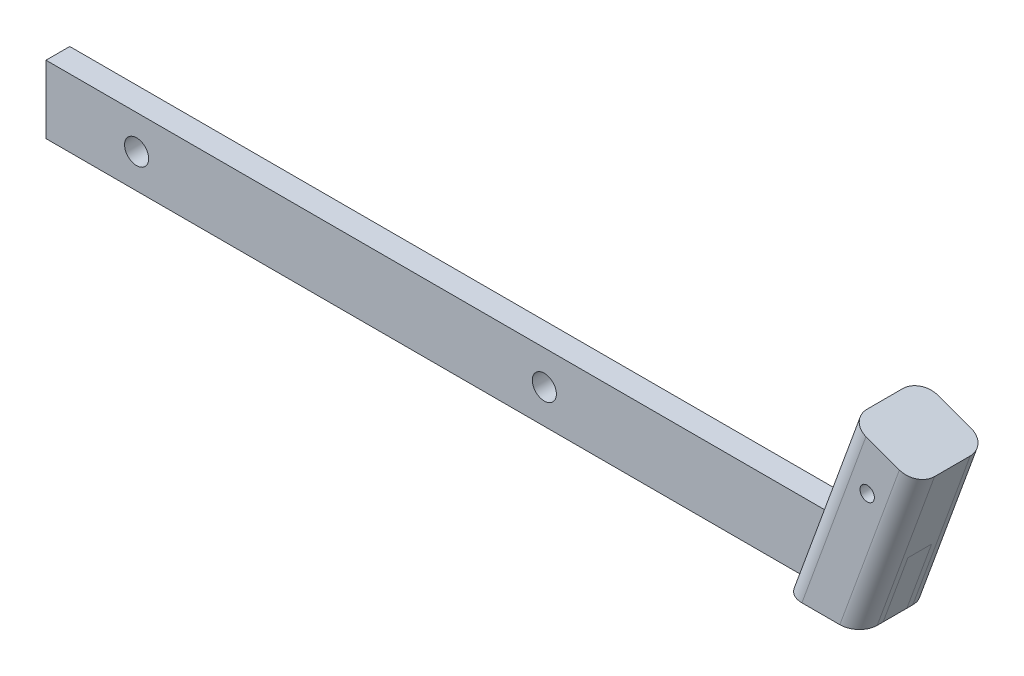
ISO-10303-21;
HEADER;
FILE_DESCRIPTION(('STEP AP214'),'2;1');
FILE_NAME('part.step','',(''),(''),'','','');
FILE_SCHEMA(('AUTOMOTIVE_DESIGN { 1 0 10303 214 1 1 1 1 }'));
ENDSEC;
DATA;
#1=APPLICATION_CONTEXT('core data for automotive mechanical design processes');
#2=APPLICATION_PROTOCOL_DEFINITION('international standard','automotive_design',2000,#1);
#3=PRODUCT_CONTEXT('',#1,'mechanical');
#4=PRODUCT('Part','Part','',(#3));
#5=PRODUCT_RELATED_PRODUCT_CATEGORY('part','',(#4));
#6=PRODUCT_DEFINITION_FORMATION('','',#4);
#7=PRODUCT_DEFINITION_CONTEXT('part definition',#1,'design');
#8=PRODUCT_DEFINITION('design','',#6,#7);
#9=PRODUCT_DEFINITION_SHAPE('','',#8);
#10=(LENGTH_UNIT() NAMED_UNIT(*) SI_UNIT(.MILLI.,.METRE.));
#11=(NAMED_UNIT(*) PLANE_ANGLE_UNIT() SI_UNIT($,.RADIAN.));
#12=(NAMED_UNIT(*) SI_UNIT($,.STERADIAN.) SOLID_ANGLE_UNIT());
#13=UNCERTAINTY_MEASURE_WITH_UNIT(LENGTH_MEASURE(1.E-05),#10,'distance_accuracy_value','');
#14=(GEOMETRIC_REPRESENTATION_CONTEXT(3) GLOBAL_UNCERTAINTY_ASSIGNED_CONTEXT((#13)) GLOBAL_UNIT_ASSIGNED_CONTEXT((#10,
#11,#12)) REPRESENTATION_CONTEXT('',''));
#15=CARTESIAN_POINT('',(0.,0.,0.));
#16=DIRECTION('',(0.,0.,1.));
#17=DIRECTION('',(1.,0.,0.));
#18=AXIS2_PLACEMENT_3D('',#15,#16,#17);
#19=CARTESIAN_POINT('',(-0.591461060722706,-31.0709524033044,-10.0711));
#20=DIRECTION('',(0.939692620785907,-0.342020143325673,0.));
#21=DIRECTION('',(0.342020143325673,0.939692620785907,0.));
#22=AXIS2_PLACEMENT_3D('',#19,#20,#21);
#23=PLANE('',#22);
#24=DIRECTION('',(-0.342020143325673,-0.939692620785907,0.));
#25=VECTOR('',#24,1.);
#26=CARTESIAN_POINT('',(13.5592119812616,7.80770224963224,-3.32740000000001));
#27=LINE('',#26,#25);
#28=CARTESIAN_POINT('',(17.6510737271534,19.05,-3.32740000000001));
#29=VERTEX_POINT('',#28);
#30=CARTESIAN_POINT('',(10.7174407643822,0.,-3.32740000000001));
#31=VERTEX_POINT('',#30);
#32=EDGE_CURVE('E57',#29,#31,#27,.T.);
#33=ORIENTED_EDGE('',*,*,#32,.F.);
#34=DIRECTION('',(0.,0.,-1.));
#35=VECTOR('',#34,1.);
#36=CARTESIAN_POINT('',(17.6510737271534,19.05,-3.3274));
#37=LINE('',#36,#35);
#38=CARTESIAN_POINT('',(17.6510737271534,19.05,3.32739999999999));
#39=VERTEX_POINT('',#38);
#40=EDGE_CURVE('E80',#39,#29,#37,.T.);
#41=ORIENTED_EDGE('',*,*,#40,.F.);
#42=DIRECTION('',(0.342020143325673,0.939692620785907,0.));
#43=VECTOR('',#42,1.);
#44=CARTESIAN_POINT('',(13.5592119812616,7.80770224963224,3.3274));
#45=LINE('',#44,#43);
#46=CARTESIAN_POINT('',(10.7174407643822,0.,3.32740000000001));
#47=VERTEX_POINT('',#46);
#48=EDGE_CURVE('E85',#47,#39,#45,.T.);
#49=ORIENTED_EDGE('',*,*,#48,.F.);
#50=DIRECTION('',(0.,0.,1.));
#51=VECTOR('',#50,1.);
#52=CARTESIAN_POINT('',(10.7174407643822,0.,-3.3274));
#53=LINE('',#52,#51);
#54=EDGE_CURVE('E100',#31,#47,#53,.T.);
#55=ORIENTED_EDGE('',*,*,#54,.F.);
#56=EDGE_LOOP('',(#33,#41,#49,#55));
#57=FACE_BOUND('',#56,.T.);
#58=ADVANCED_FACE('F49',(#57),#23,.T.);
#59=CARTESIAN_POINT('',(-223.965917593072,0.,0.));
#60=DIRECTION('',(1.,0.,0.));
#61=DIRECTION('',(0.,0.,-1.));
#62=AXIS2_PLACEMENT_3D('',#59,#60,#61);
#63=PLANE('',#62);
#64=DIRECTION('',(0.,-1.,0.));
#65=VECTOR('',#64,1.);
#66=CARTESIAN_POINT('',(-223.965917593072,0.,-3.32740000000001));
#67=LINE('',#66,#65);
#68=CARTESIAN_POINT('',(-223.965917593072,19.05,-3.32740000000001));
#69=VERTEX_POINT('',#68);
#70=CARTESIAN_POINT('',(-223.965917593072,0.,-3.32740000000001));
#71=VERTEX_POINT('',#70);
#72=EDGE_CURVE('E109',#69,#71,#67,.T.);
#73=ORIENTED_EDGE('',*,*,#72,.T.);
#74=DIRECTION('',(0.,0.,1.));
#75=VECTOR('',#74,1.);
#76=CARTESIAN_POINT('',(-223.965917593072,0.,-3.32740000000001));
#77=LINE('',#76,#75);
#78=CARTESIAN_POINT('',(-223.965917593072,0.,3.32740000000001));
#79=VERTEX_POINT('',#78);
#80=EDGE_CURVE('E98',#71,#79,#77,.T.);
#81=ORIENTED_EDGE('',*,*,#80,.T.);
#82=DIRECTION('',(0.,1.,0.));
#83=VECTOR('',#82,1.);
#84=CARTESIAN_POINT('',(-223.965917593072,0.,3.32740000000001));
#85=LINE('',#84,#83);
#86=CARTESIAN_POINT('',(-223.965917593072,19.05,3.32739999999999));
#87=VERTEX_POINT('',#86);
#88=EDGE_CURVE('E101',#79,#87,#85,.T.);
#89=ORIENTED_EDGE('',*,*,#88,.T.);
#90=DIRECTION('',(0.,0.,-1.));
#91=VECTOR('',#90,1.);
#92=CARTESIAN_POINT('',(-223.965917593072,19.05,-3.32740000000001));
#93=LINE('',#92,#91);
#94=EDGE_CURVE('E106',#87,#69,#93,.T.);
#95=ORIENTED_EDGE('',*,*,#94,.T.);
#96=EDGE_LOOP('',(#73,#81,#89,#95));
#97=FACE_BOUND('',#96,.T.);
#98=ADVANCED_FACE('F108',(#97),#63,.F.);
#99=CARTESIAN_POINT('',(35.010697609951,0.,-3.32740000000001));
#100=DIRECTION('',(0.,-1.,0.));
#101=DIRECTION('',(1.,0.,0.));
#102=AXIS2_PLACEMENT_3D('',#99,#100,#101);
#103=PLANE('',#102);
#104=DIRECTION('',(-1.,0.,0.));
#105=VECTOR('',#104,1.);
#106=CARTESIAN_POINT('',(35.010697609951,0.,-3.32740000000001));
#107=LINE('',#106,#105);
#108=EDGE_CURVE('E12',#31,#71,#107,.T.);
#109=ORIENTED_EDGE('',*,*,#108,.F.);
#110=ORIENTED_EDGE('',*,*,#54,.T.);
#111=DIRECTION('',(-1.,0.,0.));
#112=VECTOR('',#111,1.);
#113=CARTESIAN_POINT('',(35.010697609951,0.,3.32740000000001));
#114=LINE('',#113,#112);
#115=EDGE_CURVE('E95',#47,#79,#114,.T.);
#116=ORIENTED_EDGE('',*,*,#115,.T.);
#117=ORIENTED_EDGE('',*,*,#80,.F.);
#118=EDGE_LOOP('',(#109,#110,#116,#117));
#119=FACE_BOUND('',#118,.T.);
#120=ADVANCED_FACE('F96',(#119),#103,.T.);
#121=CARTESIAN_POINT('',(35.010697609951,0.,3.32740000000001));
#122=DIRECTION('',(0.,0.,1.));
#123=DIRECTION('',(0.,-1.,0.));
#124=AXIS2_PLACEMENT_3D('',#121,#122,#123);
#125=PLANE('',#124);
#126=CARTESIAN_POINT('',(-198.565917593072,9.52499999999997,3.3274));
#127=DIRECTION('',(0.,0.,1.));
#128=DIRECTION('',(0.,-1.,0.));
#129=AXIS2_PLACEMENT_3D('',#126,#127,#128);
#130=CIRCLE('',#129,3.3782);
#131=CARTESIAN_POINT('',(-198.565917593072,6.14679999999997,3.3274));
#132=VERTEX_POINT('',#131);
#133=EDGE_CURVE('E131',#132,#132,#130,.T.);
#134=ORIENTED_EDGE('',*,*,#133,.F.);
#135=EDGE_LOOP('',(#134));
#136=FACE_BOUND('',#135,.T.);
#137=CARTESIAN_POINT('',(-84.2659175930719,9.52499999999995,3.3274));
#138=DIRECTION('',(0.,0.,1.));
#139=DIRECTION('',(0.,-1.,0.));
#140=AXIS2_PLACEMENT_3D('',#137,#138,#139);
#141=CIRCLE('',#140,3.3782);
#142=CARTESIAN_POINT('',(-84.2659175930719,6.14679999999996,3.3274));
#143=VERTEX_POINT('',#142);
#144=EDGE_CURVE('E111',#143,#143,#141,.T.);
#145=ORIENTED_EDGE('',*,*,#144,.F.);
#146=EDGE_LOOP('',(#145));
#147=FACE_BOUND('',#146,.T.);
#148=ORIENTED_EDGE('',*,*,#115,.F.);
#149=ORIENTED_EDGE('',*,*,#48,.T.);
#150=DIRECTION('',(-1.,0.,0.));
#151=VECTOR('',#150,1.);
#152=CARTESIAN_POINT('',(35.010697609951,19.05,3.32739999999999));
#153=LINE('',#152,#151);
#154=EDGE_CURVE('E90',#39,#87,#153,.T.);
#155=ORIENTED_EDGE('',*,*,#154,.T.);
#156=ORIENTED_EDGE('',*,*,#88,.F.);
#157=EDGE_LOOP('',(#148,#149,#155,#156));
#158=FACE_BOUND('',#157,.T.);
#159=ADVANCED_FACE('F102',(#136,#147,#158),#125,.T.);
#160=CARTESIAN_POINT('',(35.010697609951,19.05,-3.32740000000001));
#161=DIRECTION('',(0.,1.,0.));
#162=DIRECTION('',(-1.,0.,0.));
#163=AXIS2_PLACEMENT_3D('',#160,#161,#162);
#164=PLANE('',#163);
#165=ORIENTED_EDGE('',*,*,#154,.F.);
#166=ORIENTED_EDGE('',*,*,#40,.T.);
#167=DIRECTION('',(-1.,0.,0.));
#168=VECTOR('',#167,1.);
#169=CARTESIAN_POINT('',(35.010697609951,19.05,-3.32740000000001));
#170=LINE('',#169,#168);
#171=EDGE_CURVE('E117',#29,#69,#170,.T.);
#172=ORIENTED_EDGE('',*,*,#171,.T.);
#173=ORIENTED_EDGE('',*,*,#94,.F.);
#174=EDGE_LOOP('',(#165,#166,#172,#173));
#175=FACE_BOUND('',#174,.T.);
#176=ADVANCED_FACE('F123',(#175),#164,.T.);
#177=CARTESIAN_POINT('',(35.010697609951,0.,-3.32740000000001));
#178=DIRECTION('',(0.,0.,-1.));
#179=DIRECTION('',(-1.,0.,0.));
#180=AXIS2_PLACEMENT_3D('',#177,#178,#179);
#181=PLANE('',#180);
#182=CARTESIAN_POINT('',(-198.565917593072,9.52499999999997,-3.32740000000001));
#183=DIRECTION('',(0.,0.,-1.));
#184=DIRECTION('',(-1.,0.,0.));
#185=AXIS2_PLACEMENT_3D('',#182,#183,#184);
#186=CIRCLE('',#185,3.3782);
#187=CARTESIAN_POINT('',(-201.944117593072,9.52499999999997,-3.32740000000001));
#188=VERTEX_POINT('',#187);
#189=EDGE_CURVE('E134',#188,#188,#186,.T.);
#190=ORIENTED_EDGE('',*,*,#189,.F.);
#191=EDGE_LOOP('',(#190));
#192=FACE_BOUND('',#191,.T.);
#193=CARTESIAN_POINT('',(-84.2659175930719,9.52499999999995,-3.32740000000001));
#194=DIRECTION('',(0.,0.,-1.));
#195=DIRECTION('',(-1.,0.,0.));
#196=AXIS2_PLACEMENT_3D('',#193,#194,#195);
#197=CIRCLE('',#196,3.3782);
#198=CARTESIAN_POINT('',(-87.6441175930719,9.52499999999995,-3.32740000000001));
#199=VERTEX_POINT('',#198);
#200=EDGE_CURVE('E128',#199,#199,#197,.T.);
#201=ORIENTED_EDGE('',*,*,#200,.F.);
#202=EDGE_LOOP('',(#201));
#203=FACE_BOUND('',#202,.T.);
#204=ORIENTED_EDGE('',*,*,#171,.F.);
#205=ORIENTED_EDGE('',*,*,#32,.T.);
#206=ORIENTED_EDGE('',*,*,#108,.T.);
#207=ORIENTED_EDGE('',*,*,#72,.F.);
#208=EDGE_LOOP('',(#204,#205,#206,#207));
#209=FACE_BOUND('',#208,.T.);
#210=ADVANCED_FACE('F124',(#192,#203,#209),#181,.T.);
#211=CARTESIAN_POINT('',(-84.2659175930719,9.52499999999995,-3.32740000000001));
#212=DIRECTION('',(0.,0.,-1.));
#213=DIRECTION('',(-1.,0.,0.));
#214=AXIS2_PLACEMENT_3D('',#211,#212,#213);
#215=CYLINDRICAL_SURFACE('',#214,3.3782);
#216=ORIENTED_EDGE('',*,*,#144,.T.);
#217=EDGE_LOOP('',(#216));
#218=FACE_BOUND('',#217,.T.);
#219=ORIENTED_EDGE('',*,*,#200,.T.);
#220=EDGE_LOOP('',(#219));
#221=FACE_BOUND('',#220,.T.);
#222=ADVANCED_FACE('F142',(#218,#221),#215,.F.);
#223=CARTESIAN_POINT('',(-198.565917593072,9.52499999999997,-3.32740000000001));
#224=DIRECTION('',(0.,0.,-1.));
#225=DIRECTION('',(-1.,0.,0.));
#226=AXIS2_PLACEMENT_3D('',#223,#224,#225);
#227=CYLINDRICAL_SURFACE('',#226,3.3782);
#228=ORIENTED_EDGE('',*,*,#133,.T.);
#229=EDGE_LOOP('',(#228));
#230=FACE_BOUND('',#229,.T.);
#231=ORIENTED_EDGE('',*,*,#189,.T.);
#232=EDGE_LOOP('',(#231));
#233=FACE_BOUND('',#232,.T.);
#234=ADVANCED_FACE('F138',(#230,#233),#227,.F.);
#235=CLOSED_SHELL('',(#58,#98,#120,#159,#176,#210,#222,#234));
#236=MANIFOLD_SOLID_BREP('B2',#235);
#237=CARTESIAN_POINT('',(0.,0.,0.));
#238=DIRECTION('',(0.,1.,0.));
#239=DIRECTION('',(0.,0.,1.));
#240=AXIS2_PLACEMENT_3D('',#237,#238,#239);
#241=PLANE('',#240);
#242=DIRECTION('',(0.,0.,1.));
#243=VECTOR('',#242,1.);
#244=CARTESIAN_POINT('',(10.7174407643822,0.,-10.0711));
#245=LINE('',#244,#243);
#246=CARTESIAN_POINT('',(10.7174407643822,0.,3.32740000000001));
#247=VERTEX_POINT('',#246);
#248=CARTESIAN_POINT('',(10.7174407643822,0.,4.9911));
#249=VERTEX_POINT('',#248);
#250=EDGE_CURVE('E302',#247,#249,#245,.T.);
#251=ORIENTED_EDGE('',*,*,#250,.T.);
#252=CARTESIAN_POINT('',(5.31141768020453,0.,4.9911));
#253=DIRECTION('',(0.,1.,0.));
#254=DIRECTION('',(1.,0.,0.));
#255=AXIS2_PLACEMENT_3D('',#252,#253,#254);
#256=ELLIPSE('',#255,5.40602308417764,5.08);
#257=CARTESIAN_POINT('',(5.31141768020453,0.,10.0711));
#258=VERTEX_POINT('',#257);
#259=EDGE_CURVE('E355',#249,#258,#256,.F.);
#260=ORIENTED_EDGE('',*,*,#259,.T.);
#261=DIRECTION('',(-1.,0.,0.));
#262=VECTOR('',#261,1.);
#263=CARTESIAN_POINT('',(-0.591461060722696,0.,10.0711));
#264=LINE('',#263,#262);
#265=CARTESIAN_POINT('',(-5.31141768020453,0.,10.0711));
#266=VERTEX_POINT('',#265);
#267=EDGE_CURVE('E325',#258,#266,#264,.T.);
#268=ORIENTED_EDGE('',*,*,#267,.T.);
#269=CARTESIAN_POINT('',(-5.31141768020453,0.,4.9911));
#270=DIRECTION('',(0.,1.,0.));
#271=DIRECTION('',(1.,0.,0.));
#272=AXIS2_PLACEMENT_3D('',#269,#270,#271);
#273=ELLIPSE('',#272,5.40602308417764,5.08);
#274=CARTESIAN_POINT('',(-10.7174407643822,0.,4.9911));
#275=VERTEX_POINT('',#274);
#276=EDGE_CURVE('E353',#266,#275,#273,.F.);
#277=ORIENTED_EDGE('',*,*,#276,.T.);
#278=DIRECTION('',(0.,0.,-1.));
#279=VECTOR('',#278,1.);
#280=CARTESIAN_POINT('',(-10.7174407643822,0.,-10.0711));
#281=LINE('',#280,#279);
#282=CARTESIAN_POINT('',(-10.7174407643822,0.,3.32740000000001));
#283=VERTEX_POINT('',#282);
#284=EDGE_CURVE('E305',#275,#283,#281,.T.);
#285=ORIENTED_EDGE('',*,*,#284,.T.);
#286=DIRECTION('',(-1.,0.,0.));
#287=VECTOR('',#286,1.);
#288=CARTESIAN_POINT('',(35.010697609951,0.,3.32740000000001));
#289=LINE('',#288,#287);
#290=EDGE_CURVE('E292',#247,#283,#289,.T.);
#291=ORIENTED_EDGE('',*,*,#290,.F.);
#292=EDGE_LOOP('',(#251,#260,#268,#277,#285,#291));
#293=FACE_BOUND('',#292,.T.);
#294=ADVANCED_FACE('F199',(#293),#241,.F.);
#295=CARTESIAN_POINT('',(-19.5189377671166,-24.18191427241,-10.0711));
#296=DIRECTION('',(-0.939692620785907,0.342020143325673,0.));
#297=DIRECTION('',(-0.342020143325673,-0.939692620785907,0.));
#298=AXIS2_PLACEMENT_3D('',#295,#296,#297);
#299=PLANE('',#298);
#300=ORIENTED_EDGE('',*,*,#284,.F.);
#301=DIRECTION('',(0.342020143325673,0.939692620785907,0.));
#302=VECTOR('',#301,1.);
#303=CARTESIAN_POINT('',(-19.5189377671166,-24.18191427241,4.9911));
#304=LINE('',#303,#302);
#305=CARTESIAN_POINT('',(7.87034405373116,51.0695190654472,4.9911));
#306=VERTEX_POINT('',#305);
#307=EDGE_CURVE('E359',#275,#306,#304,.T.);
#308=ORIENTED_EDGE('',*,*,#307,.T.);
#309=DIRECTION('',(0.,0.,1.));
#310=VECTOR('',#309,1.);
#311=CARTESIAN_POINT('',(7.87034405373115,51.0695190654472,-10.0711));
#312=LINE('',#311,#310);
#313=CARTESIAN_POINT('',(7.87034405373116,51.0695190654472,-4.9911));
#314=VERTEX_POINT('',#313);
#315=EDGE_CURVE('E326',#314,#306,#312,.T.);
#316=ORIENTED_EDGE('',*,*,#315,.F.);
#317=DIRECTION('',(0.342020143325673,0.939692620785907,0.));
#318=VECTOR('',#317,1.);
#319=CARTESIAN_POINT('',(-19.5189377671166,-24.18191427241,-4.9911));
#320=LINE('',#319,#318);
#321=CARTESIAN_POINT('',(-10.7174407643822,0.,-4.9911));
#322=VERTEX_POINT('',#321);
#323=EDGE_CURVE('E357',#314,#322,#320,.F.);
#324=ORIENTED_EDGE('',*,*,#323,.T.);
#325=CARTESIAN_POINT('',(-10.7174407643822,0.,-3.32740000000001));
#326=VERTEX_POINT('',#325);
#327=EDGE_CURVE('E323',#326,#322,#281,.T.);
#328=ORIENTED_EDGE('',*,*,#327,.F.);
#329=DIRECTION('',(-0.342020143325673,-0.939692620785907,0.));
#330=VECTOR('',#329,1.);
#331=CARTESIAN_POINT('',(-19.5189377671166,-24.18191427241,-3.32740000000001));
#332=LINE('',#331,#330);
#333=CARTESIAN_POINT('',(-3.78380780161094,19.05,-3.32740000000001));
#334=VERTEX_POINT('',#333);
#335=EDGE_CURVE('E496',#334,#326,#332,.T.);
#336=ORIENTED_EDGE('',*,*,#335,.F.);
#337=DIRECTION('',(0.,0.,-1.));
#338=VECTOR('',#337,1.);
#339=CARTESIAN_POINT('',(-3.78380780161093,19.05,-10.0711));
#340=LINE('',#339,#338);
#341=CARTESIAN_POINT('',(-3.78380780161093,19.05,3.32739999999999));
#342=VERTEX_POINT('',#341);
#343=EDGE_CURVE('E489',#342,#334,#340,.T.);
#344=ORIENTED_EDGE('',*,*,#343,.F.);
#345=DIRECTION('',(0.342020143325673,0.939692620785907,0.));
#346=VECTOR('',#345,1.);
#347=CARTESIAN_POINT('',(-19.5189377671166,-24.18191427241,3.32740000000003));
#348=LINE('',#347,#346);
#349=EDGE_CURVE('E494',#283,#342,#348,.T.);
#350=ORIENTED_EDGE('',*,*,#349,.F.);
#351=EDGE_LOOP('',(#300,#308,#316,#324,#328,#336,#344,#350));
#352=FACE_BOUND('',#351,.T.);
#353=ADVANCED_FACE('F383',(#352),#299,.T.);
#354=CARTESIAN_POINT('',(-0.591461060722703,-31.0709524033044,-10.0711));
#355=DIRECTION('',(0.,0.,-1.));
#356=DIRECTION('',(-1.,0.,0.));
#357=AXIS2_PLACEMENT_3D('',#354,#355,#356);
#358=PLANE('',#357);
#359=CARTESIAN_POINT('',(12.9904265866921,35.690903716019,-10.0711));
#360=DIRECTION('',(0.,0.,-1.));
#361=DIRECTION('',(0.,1.,0.));
#362=AXIS2_PLACEMENT_3D('',#359,#360,#361);
#363=CIRCLE('',#362,2.01929999999999);
#364=CARTESIAN_POINT('',(12.9904265866921,37.710203716019,-10.0711));
#365=VERTEX_POINT('',#364);
#366=EDGE_CURVE('E493',#365,#365,#363,.T.);
#367=ORIENTED_EDGE('',*,*,#366,.F.);
#368=EDGE_LOOP('',(#367));
#369=FACE_BOUND('',#368,.T.);
#370=DIRECTION('',(1.,0.,0.));
#371=VECTOR('',#370,1.);
#372=CARTESIAN_POINT('',(-0.591461060722703,0.,-10.0711));
#373=LINE('',#372,#371);
#374=CARTESIAN_POINT('',(-5.31141768020453,0.,-10.0711));
#375=VERTEX_POINT('',#374);
#376=CARTESIAN_POINT('',(5.31141768020453,0.,-10.0711));
#377=VERTEX_POINT('',#376);
#378=EDGE_CURVE('E314',#375,#377,#373,.T.);
#379=ORIENTED_EDGE('',*,*,#378,.F.);
#380=DIRECTION('',(0.342020143325673,0.939692620785907,0.));
#381=VECTOR('',#380,1.);
#382=CARTESIAN_POINT('',(-14.7452992535242,-25.9193766005045,-10.0711));
#383=LINE('',#382,#381);
#384=CARTESIAN_POINT('',(12.6439825673236,49.3320567373528,-10.0711));
#385=VERTEX_POINT('',#384);
#386=EDGE_CURVE('E363',#375,#385,#383,.T.);
#387=ORIENTED_EDGE('',*,*,#386,.T.);
#388=DIRECTION('',(-0.939692620785907,0.342020143325673,0.));
#389=VECTOR('',#388,1.);
#390=CARTESIAN_POINT('',(26.797820760125,44.1804809345528,-10.0711));
#391=LINE('',#390,#389);
#392=CARTESIAN_POINT('',(22.0241822465326,45.9179432626472,-10.0711));
#393=VERTEX_POINT('',#392);
#394=EDGE_CURVE('E312',#393,#385,#391,.T.);
#395=ORIENTED_EDGE('',*,*,#394,.F.);
#396=DIRECTION('',(0.342020143325673,0.939692620785907,0.));
#397=VECTOR('',#396,1.);
#398=CARTESIAN_POINT('',(-5.36509957431511,-29.33349007521,-10.0711));
#399=LINE('',#398,#397);
#400=EDGE_CURVE('E214',#393,#377,#399,.F.);
#401=ORIENTED_EDGE('',*,*,#400,.T.);
#402=EDGE_LOOP('',(#379,#387,#395,#401));
#403=FACE_BOUND('',#402,.T.);
#404=ADVANCED_FACE('F376',(#369,#403),#358,.T.);
#405=CARTESIAN_POINT('',(-0.591461060722703,-31.0709524033044,-10.0711));
#406=DIRECTION('',(0.939692620785907,-0.342020143325673,0.));
#407=DIRECTION('',(0.342020143325673,0.939692620785907,0.));
#408=AXIS2_PLACEMENT_3D('',#405,#406,#407);
#409=PLANE('',#408);
#410=DIRECTION('',(0.,0.,-1.));
#411=VECTOR('',#410,1.);
#412=CARTESIAN_POINT('',(26.797820760125,44.1804809345528,-10.0711));
#413=LINE('',#412,#411);
#414=CARTESIAN_POINT('',(26.797820760125,44.1804809345528,4.9911));
#415=VERTEX_POINT('',#414);
#416=CARTESIAN_POINT('',(26.797820760125,44.1804809345528,-4.9911));
#417=VERTEX_POINT('',#416);
#418=EDGE_CURVE('E316',#415,#417,#413,.T.);
#419=ORIENTED_EDGE('',*,*,#418,.F.);
#420=DIRECTION('',(0.342020143325673,0.939692620785907,0.));
#421=VECTOR('',#420,1.);
#422=CARTESIAN_POINT('',(-0.591461060722697,-31.0709524033044,4.9911));
#423=LINE('',#422,#421);
#424=EDGE_CURVE('E310',#415,#249,#423,.F.);
#425=ORIENTED_EDGE('',*,*,#424,.T.);
#426=ORIENTED_EDGE('',*,*,#250,.F.);
#427=DIRECTION('',(0.342020143325673,0.939692620785907,0.));
#428=VECTOR('',#427,1.);
#429=CARTESIAN_POINT('',(13.5592119812616,7.80770224963224,3.3274));
#430=LINE('',#429,#428);
#431=CARTESIAN_POINT('',(17.6510737271534,19.05,3.32739999999999));
#432=VERTEX_POINT('',#431);
#433=EDGE_CURVE('E289',#247,#432,#430,.T.);
#434=ORIENTED_EDGE('',*,*,#433,.T.);
#435=DIRECTION('',(0.,0.,-1.));
#436=VECTOR('',#435,1.);
#437=CARTESIAN_POINT('',(17.6510737271534,19.05,-3.3274));
#438=LINE('',#437,#436);
#439=CARTESIAN_POINT('',(17.6510737271534,19.05,-3.32740000000001));
#440=VERTEX_POINT('',#439);
#441=EDGE_CURVE('E497',#432,#440,#438,.T.);
#442=ORIENTED_EDGE('',*,*,#441,.T.);
#443=DIRECTION('',(-0.342020143325673,-0.939692620785907,0.));
#444=VECTOR('',#443,1.);
#445=CARTESIAN_POINT('',(13.5592119812616,7.80770224963224,-3.32740000000001));
#446=LINE('',#445,#444);
#447=CARTESIAN_POINT('',(10.7174407643822,0.,-3.32740000000001));
#448=VERTEX_POINT('',#447);
#449=EDGE_CURVE('E373',#440,#448,#446,.T.);
#450=ORIENTED_EDGE('',*,*,#449,.T.);
#451=CARTESIAN_POINT('',(10.7174407643822,0.,-4.9911));
#452=VERTEX_POINT('',#451);
#453=EDGE_CURVE('E311',#452,#448,#245,.T.);
#454=ORIENTED_EDGE('',*,*,#453,.F.);
#455=DIRECTION('',(0.342020143325673,0.939692620785907,0.));
#456=VECTOR('',#455,1.);
#457=CARTESIAN_POINT('',(-0.591461060722701,-31.0709524033044,-4.9911));
#458=LINE('',#457,#456);
#459=EDGE_CURVE('E349',#452,#417,#458,.T.);
#460=ORIENTED_EDGE('',*,*,#459,.T.);
#461=EDGE_LOOP('',(#419,#425,#426,#434,#442,#450,#454,#460));
#462=FACE_BOUND('',#461,.T.);
#463=ADVANCED_FACE('F308',(#462),#409,.T.);
#464=CARTESIAN_POINT('',(-0.591461060722696,-31.0709524033044,10.0711));
#465=DIRECTION('',(0.,0.,1.));
#466=DIRECTION('',(1.,0.,0.));
#467=AXIS2_PLACEMENT_3D('',#464,#465,#466);
#468=PLANE('',#467);
#469=CARTESIAN_POINT('',(12.9904265866921,35.690903716019,10.0711));
#470=DIRECTION('',(0.,0.,-1.));
#471=DIRECTION('',(0.,1.,0.));
#472=AXIS2_PLACEMENT_3D('',#469,#470,#471);
#473=CIRCLE('',#472,2.01929999999999);
#474=CARTESIAN_POINT('',(12.9904265866921,37.710203716019,10.0711));
#475=VERTEX_POINT('',#474);
#476=EDGE_CURVE('E320',#475,#475,#473,.T.);
#477=ORIENTED_EDGE('',*,*,#476,.T.);
#478=EDGE_LOOP('',(#477));
#479=FACE_BOUND('',#478,.T.);
#480=ORIENTED_EDGE('',*,*,#267,.F.);
#481=DIRECTION('',(0.342020143325673,0.939692620785907,0.));
#482=VECTOR('',#481,1.);
#483=CARTESIAN_POINT('',(-5.3650995743151,-29.33349007521,10.0711));
#484=LINE('',#483,#482);
#485=CARTESIAN_POINT('',(22.0241822465326,45.9179432626472,10.0711));
#486=VERTEX_POINT('',#485);
#487=EDGE_CURVE('E338',#258,#486,#484,.T.);
#488=ORIENTED_EDGE('',*,*,#487,.T.);
#489=DIRECTION('',(0.939692620785907,-0.342020143325673,0.));
#490=VECTOR('',#489,1.);
#491=CARTESIAN_POINT('',(26.7978207601251,44.1804809345528,10.0711));
#492=LINE('',#491,#490);
#493=CARTESIAN_POINT('',(12.6439825673236,49.3320567373528,10.0711));
#494=VERTEX_POINT('',#493);
#495=EDGE_CURVE('E329',#494,#486,#492,.T.);
#496=ORIENTED_EDGE('',*,*,#495,.F.);
#497=DIRECTION('',(0.342020143325673,0.939692620785907,0.));
#498=VECTOR('',#497,1.);
#499=CARTESIAN_POINT('',(-14.7452992535242,-25.9193766005045,10.0711));
#500=LINE('',#499,#498);
#501=EDGE_CURVE('E336',#494,#266,#500,.F.);
#502=ORIENTED_EDGE('',*,*,#501,.T.);
#503=EDGE_LOOP('',(#480,#488,#496,#502));
#504=FACE_BOUND('',#503,.T.);
#505=ADVANCED_FACE('F393',(#479,#504),#468,.T.);
#506=CARTESIAN_POINT('',(17.3340824069281,47.625,0.));
#507=DIRECTION('',(-0.342020143325673,-0.939692620785907,0.));
#508=DIRECTION('',(0.939692620785907,-0.342020143325673,0.));
#509=AXIS2_PLACEMENT_3D('',#506,#507,#508);
#510=PLANE('',#509);
#511=ORIENTED_EDGE('',*,*,#495,.T.);
#512=CARTESIAN_POINT('',(22.0241822465326,45.9179432626472,4.9911));
#513=DIRECTION('',(-0.342020143325673,-0.939692620785907,0.));
#514=DIRECTION('',(0.939692620785907,-0.342020143325673,0.));
#515=AXIS2_PLACEMENT_3D('',#512,#513,#514);
#516=CIRCLE('',#515,5.08);
#517=EDGE_CURVE('E347',#486,#415,#516,.F.);
#518=ORIENTED_EDGE('',*,*,#517,.T.);
#519=ORIENTED_EDGE('',*,*,#418,.T.);
#520=CARTESIAN_POINT('',(22.0241822465326,45.9179432626472,-4.9911));
#521=DIRECTION('',(-0.342020143325673,-0.939692620785907,0.));
#522=DIRECTION('',(0.939692620785907,-0.342020143325673,0.));
#523=AXIS2_PLACEMENT_3D('',#520,#521,#522);
#524=CIRCLE('',#523,5.08);
#525=EDGE_CURVE('E341',#417,#393,#524,.F.);
#526=ORIENTED_EDGE('',*,*,#525,.T.);
#527=ORIENTED_EDGE('',*,*,#394,.T.);
#528=CARTESIAN_POINT('',(12.6439825673236,49.3320567373528,-4.9911));
#529=DIRECTION('',(-0.342020143325673,-0.939692620785907,0.));
#530=DIRECTION('',(0.939692620785907,-0.342020143325673,0.));
#531=AXIS2_PLACEMENT_3D('',#528,#529,#530);
#532=CIRCLE('',#531,5.08);
#533=EDGE_CURVE('E343',#385,#314,#532,.F.);
#534=ORIENTED_EDGE('',*,*,#533,.T.);
#535=ORIENTED_EDGE('',*,*,#315,.T.);
#536=CARTESIAN_POINT('',(12.6439825673236,49.3320567373528,4.9911));
#537=DIRECTION('',(-0.342020143325673,-0.939692620785907,0.));
#538=DIRECTION('',(0.939692620785907,-0.342020143325673,0.));
#539=AXIS2_PLACEMENT_3D('',#536,#537,#538);
#540=CIRCLE('',#539,5.08);
#541=EDGE_CURVE('E345',#306,#494,#540,.F.);
#542=ORIENTED_EDGE('',*,*,#541,.T.);
#543=EDGE_LOOP('',(#511,#518,#519,#526,#527,#534,#535,#542));
#544=FACE_BOUND('',#543,.T.);
#545=ADVANCED_FACE('F375',(#544),#510,.F.);
#546=ORIENTED_EDGE('',*,*,#327,.T.);
#547=CARTESIAN_POINT('',(-5.31141768020454,0.,-4.9911));
#548=DIRECTION('',(0.,1.,0.));
#549=DIRECTION('',(1.,0.,0.));
#550=AXIS2_PLACEMENT_3D('',#547,#548,#549);
#551=ELLIPSE('',#550,5.40602308417764,5.08);
#552=EDGE_CURVE('E47',#322,#375,#551,.F.);
#553=ORIENTED_EDGE('',*,*,#552,.T.);
#554=ORIENTED_EDGE('',*,*,#378,.T.);
#555=CARTESIAN_POINT('',(5.31141768020453,0.,-4.9911));
#556=DIRECTION('',(0.,1.,0.));
#557=DIRECTION('',(1.,0.,0.));
#558=AXIS2_PLACEMENT_3D('',#555,#556,#557);
#559=ELLIPSE('',#558,5.40602308417764,5.08);
#560=EDGE_CURVE('E207',#377,#452,#559,.F.);
#561=ORIENTED_EDGE('',*,*,#560,.T.);
#562=ORIENTED_EDGE('',*,*,#453,.T.);
#563=DIRECTION('',(-1.,0.,0.));
#564=VECTOR('',#563,1.);
#565=CARTESIAN_POINT('',(35.010697609951,0.,-3.32740000000001));
#566=LINE('',#565,#564);
#567=EDGE_CURVE('E499',#448,#326,#566,.T.);
#568=ORIENTED_EDGE('',*,*,#567,.T.);
#569=EDGE_LOOP('',(#546,#553,#554,#561,#562,#568));
#570=FACE_BOUND('',#569,.T.);
#571=ADVANCED_FACE('F367',(#570),#241,.F.);
#572=CARTESIAN_POINT('',(12.9904265866921,35.690903716019,-10.0711));
#573=DIRECTION('',(0.,0.,-1.));
#574=DIRECTION('',(0.,1.,0.));
#575=AXIS2_PLACEMENT_3D('',#572,#573,#574);
#576=CYLINDRICAL_SURFACE('',#575,2.01929999999999);
#577=ORIENTED_EDGE('',*,*,#476,.F.);
#578=EDGE_LOOP('',(#577));
#579=FACE_BOUND('',#578,.T.);
#580=ORIENTED_EDGE('',*,*,#366,.T.);
#581=EDGE_LOOP('',(#580));
#582=FACE_BOUND('',#581,.T.);
#583=ADVANCED_FACE('F417',(#579,#582),#576,.F.);
#584=CARTESIAN_POINT('',(35.010697609951,0.,3.32740000000001));
#585=DIRECTION('',(0.,0.,1.));
#586=DIRECTION('',(0.,-1.,0.));
#587=AXIS2_PLACEMENT_3D('',#584,#585,#586);
#588=PLANE('',#587);
#589=ORIENTED_EDGE('',*,*,#349,.T.);
#590=DIRECTION('',(-1.,0.,0.));
#591=VECTOR('',#590,1.);
#592=CARTESIAN_POINT('',(35.010697609951,19.05,3.32739999999999));
#593=LINE('',#592,#591);
#594=EDGE_CURVE('E295',#432,#342,#593,.T.);
#595=ORIENTED_EDGE('',*,*,#594,.F.);
#596=ORIENTED_EDGE('',*,*,#433,.F.);
#597=ORIENTED_EDGE('',*,*,#290,.T.);
#598=EDGE_LOOP('',(#589,#595,#596,#597));
#599=FACE_BOUND('',#598,.T.);
#600=ADVANCED_FACE('F291',(#599),#588,.F.);
#601=CARTESIAN_POINT('',(35.010697609951,19.05,-3.32740000000001));
#602=DIRECTION('',(0.,1.,0.));
#603=DIRECTION('',(-1.,0.,0.));
#604=AXIS2_PLACEMENT_3D('',#601,#602,#603);
#605=PLANE('',#604);
#606=ORIENTED_EDGE('',*,*,#343,.T.);
#607=DIRECTION('',(-1.,0.,0.));
#608=VECTOR('',#607,1.);
#609=CARTESIAN_POINT('',(35.010697609951,19.05,-3.32740000000001));
#610=LINE('',#609,#608);
#611=EDGE_CURVE('E491',#440,#334,#610,.T.);
#612=ORIENTED_EDGE('',*,*,#611,.F.);
#613=ORIENTED_EDGE('',*,*,#441,.F.);
#614=ORIENTED_EDGE('',*,*,#594,.T.);
#615=EDGE_LOOP('',(#606,#612,#613,#614));
#616=FACE_BOUND('',#615,.T.);
#617=ADVANCED_FACE('F405',(#616),#605,.F.);
#618=CARTESIAN_POINT('',(35.010697609951,0.,-3.32740000000001));
#619=DIRECTION('',(0.,0.,-1.));
#620=DIRECTION('',(-1.,0.,0.));
#621=AXIS2_PLACEMENT_3D('',#618,#619,#620);
#622=PLANE('',#621);
#623=ORIENTED_EDGE('',*,*,#335,.T.);
#624=ORIENTED_EDGE('',*,*,#567,.F.);
#625=ORIENTED_EDGE('',*,*,#449,.F.);
#626=ORIENTED_EDGE('',*,*,#611,.T.);
#627=EDGE_LOOP('',(#623,#624,#625,#626));
#628=FACE_BOUND('',#627,.T.);
#629=ADVANCED_FACE('F398',(#628),#622,.F.);
#630=CARTESIAN_POINT('',(-5.3650995743151,-29.33349007521,4.9911));
#631=DIRECTION('',(0.342020143325673,0.939692620785907,0.));
#632=DIRECTION('',(-0.939692620785907,0.342020143325673,0.));
#633=AXIS2_PLACEMENT_3D('',#630,#631,#632);
#634=CYLINDRICAL_SURFACE('',#633,5.08);
#635=ORIENTED_EDGE('',*,*,#259,.F.);
#636=ORIENTED_EDGE('',*,*,#424,.F.);
#637=ORIENTED_EDGE('',*,*,#517,.F.);
#638=ORIENTED_EDGE('',*,*,#487,.F.);
#639=EDGE_LOOP('',(#635,#636,#637,#638));
#640=FACE_BOUND('',#639,.T.);
#641=ADVANCED_FACE('F396',(#640),#634,.T.);
#642=CARTESIAN_POINT('',(-14.7452992535242,-25.9193766005045,4.9911));
#643=DIRECTION('',(0.342020143325673,0.939692620785907,0.));
#644=DIRECTION('',(-0.939692620785907,0.342020143325673,0.));
#645=AXIS2_PLACEMENT_3D('',#642,#643,#644);
#646=CYLINDRICAL_SURFACE('',#645,5.08);
#647=ORIENTED_EDGE('',*,*,#276,.F.);
#648=ORIENTED_EDGE('',*,*,#501,.F.);
#649=ORIENTED_EDGE('',*,*,#541,.F.);
#650=ORIENTED_EDGE('',*,*,#307,.F.);
#651=EDGE_LOOP('',(#647,#648,#649,#650));
#652=FACE_BOUND('',#651,.T.);
#653=ADVANCED_FACE('F388',(#652),#646,.T.);
#654=CARTESIAN_POINT('',(-14.7452992535242,-25.9193766005045,-4.9911));
#655=DIRECTION('',(0.342020143325673,0.939692620785907,0.));
#656=DIRECTION('',(-0.939692620785907,0.342020143325673,0.));
#657=AXIS2_PLACEMENT_3D('',#654,#655,#656);
#658=CYLINDRICAL_SURFACE('',#657,5.08);
#659=ORIENTED_EDGE('',*,*,#552,.F.);
#660=ORIENTED_EDGE('',*,*,#323,.F.);
#661=ORIENTED_EDGE('',*,*,#533,.F.);
#662=ORIENTED_EDGE('',*,*,#386,.F.);
#663=EDGE_LOOP('',(#659,#660,#661,#662));
#664=FACE_BOUND('',#663,.T.);
#665=ADVANCED_FACE('F379',(#664),#658,.T.);
#666=CARTESIAN_POINT('',(-5.36509957431511,-29.33349007521,-4.9911));
#667=DIRECTION('',(0.342020143325673,0.939692620785907,0.));
#668=DIRECTION('',(-0.939692620785907,0.342020143325673,0.));
#669=AXIS2_PLACEMENT_3D('',#666,#667,#668);
#670=CYLINDRICAL_SURFACE('',#669,5.08);
#671=ORIENTED_EDGE('',*,*,#560,.F.);
#672=ORIENTED_EDGE('',*,*,#400,.F.);
#673=ORIENTED_EDGE('',*,*,#525,.F.);
#674=ORIENTED_EDGE('',*,*,#459,.F.);
#675=EDGE_LOOP('',(#671,#672,#673,#674));
#676=FACE_BOUND('',#675,.T.);
#677=ADVANCED_FACE('F201',(#676),#670,.T.);
#678=CLOSED_SHELL('',(#294,#353,#404,#463,#505,#545,#571,#583,#600,#617,#629,#641,#653,#665,#677));
#679=MANIFOLD_SOLID_BREP('B6',#678);
#680=ADVANCED_BREP_SHAPE_REPRESENTATION('',(#18,#236,#679),#14);
#681=SHAPE_DEFINITION_REPRESENTATION(#9,#680);
ENDSEC;
END-ISO-10303-21;
